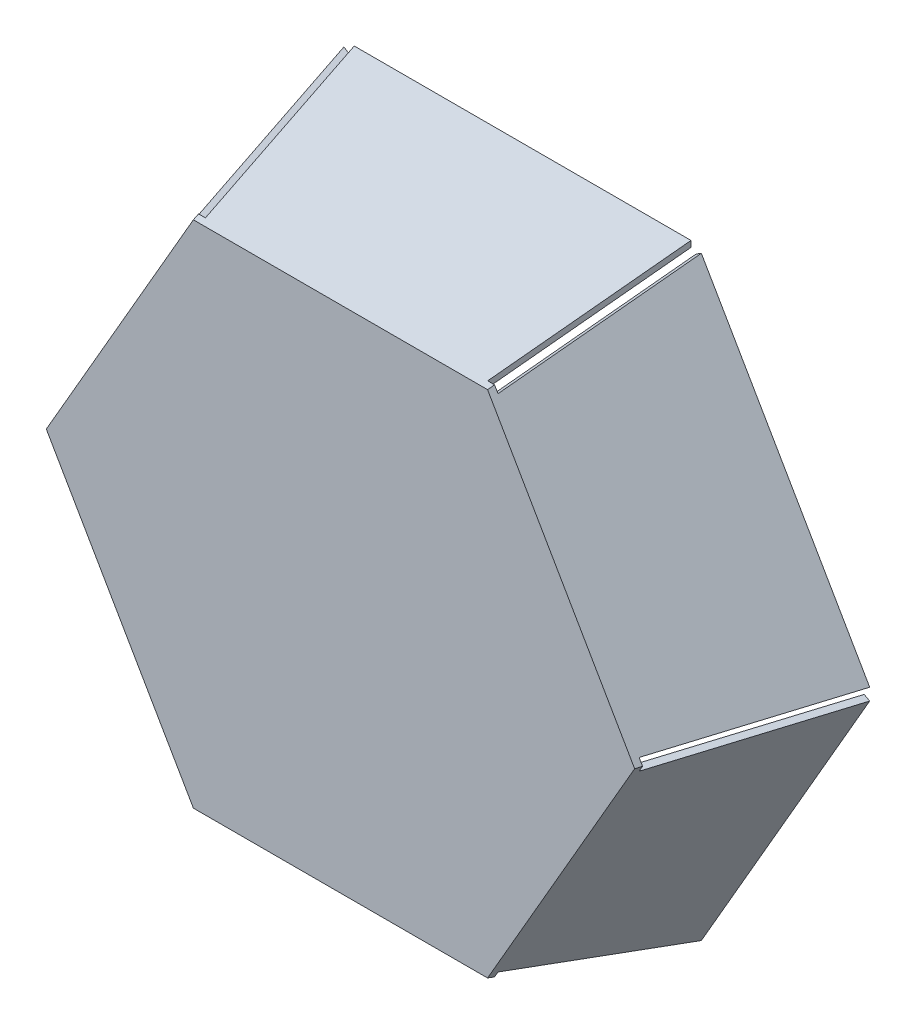
ISO-10303-21;
HEADER;
FILE_DESCRIPTION(('STEP AP214'),'2;1');
FILE_NAME('part.step','',(''),(''),'','','');
FILE_SCHEMA(('AUTOMOTIVE_DESIGN { 1 0 10303 214 1 1 1 1 }'));
ENDSEC;
DATA;
#1=APPLICATION_CONTEXT('core data for automotive mechanical design processes');
#2=APPLICATION_PROTOCOL_DEFINITION('international standard','automotive_design',2000,#1);
#3=PRODUCT_CONTEXT('',#1,'mechanical');
#4=PRODUCT('Part','Part','',(#3));
#5=PRODUCT_RELATED_PRODUCT_CATEGORY('part','',(#4));
#6=PRODUCT_DEFINITION_FORMATION('','',#4);
#7=PRODUCT_DEFINITION_CONTEXT('part definition',#1,'design');
#8=PRODUCT_DEFINITION('design','',#6,#7);
#9=PRODUCT_DEFINITION_SHAPE('','',#8);
#10=(LENGTH_UNIT() NAMED_UNIT(*) SI_UNIT(.MILLI.,.METRE.));
#11=(NAMED_UNIT(*) PLANE_ANGLE_UNIT() SI_UNIT($,.RADIAN.));
#12=(NAMED_UNIT(*) SI_UNIT($,.STERADIAN.) SOLID_ANGLE_UNIT());
#13=UNCERTAINTY_MEASURE_WITH_UNIT(LENGTH_MEASURE(1.E-05),#10,'distance_accuracy_value','');
#14=(GEOMETRIC_REPRESENTATION_CONTEXT(3) GLOBAL_UNCERTAINTY_ASSIGNED_CONTEXT((#13)) GLOBAL_UNIT_ASSIGNED_CONTEXT((#10,
#11,#12)) REPRESENTATION_CONTEXT('',''));
#15=CARTESIAN_POINT('',(0.,0.,0.));
#16=DIRECTION('',(0.,0.,1.));
#17=DIRECTION('',(1.,0.,0.));
#18=AXIS2_PLACEMENT_3D('',#15,#16,#17);
#19=CARTESIAN_POINT('',(-56.8985106152247,0.482962913144534,-0.258819045102521));
#20=DIRECTION('',(-0.836516303737808,-0.482962913144534,0.258819045102521));
#21=DIRECTION('',(0.5,-0.866025403784439,0.));
#22=AXIS2_PLACEMENT_3D('',#19,#20,#21);
#23=PLANE('',#22);
#24=DIRECTION('',(-0.5,0.866025403784439,0.));
#25=VECTOR('',#24,1.);
#26=CARTESIAN_POINT('',(-50.108978027297,4.40290138045633,29.));
#27=LINE('',#26,#25);
#28=CARTESIAN_POINT('',(-47.2782865954804,-0.500000000000001,29.));
#29=VERTEX_POINT('',#28);
#30=CARTESIAN_POINT('',(-24.0721559996324,-40.6941972390873,29.));
#31=VERTEX_POINT('',#30);
#32=EDGE_CURVE('E261',#29,#31,#27,.F.);
#33=ORIENTED_EDGE('',*,*,#32,.T.);
#34=DIRECTION('',(0.147788364107821,0.255976955402234,0.955319003127928));
#35=VECTOR('',#34,1.);
#36=CARTESIAN_POINT('',(-27.3622878055868,-46.3928726905987,7.73225367911405));
#37=LINE('',#36,#35);
#38=CARTESIAN_POINT('',(-28.5584716126307,-48.4647238195899,0.));
#39=VERTEX_POINT('',#38);
#40=EDGE_CURVE('E602',#31,#39,#37,.F.);
#41=ORIENTED_EDGE('',*,*,#40,.T.);
#42=DIRECTION('',(-0.5,0.866025403784439,0.));
#43=VECTOR('',#42,1.);
#44=CARTESIAN_POINT('',(-56.8384514467945,0.517638090205041,0.));
#45=LINE('',#44,#43);
#46=CARTESIAN_POINT('',(-56.250917821477,-0.500000000000004,0.));
#47=VERTEX_POINT('',#46);
#48=EDGE_CURVE('E474',#47,#39,#45,.F.);
#49=ORIENTED_EDGE('',*,*,#48,.F.);
#50=DIRECTION('',(-0.295576728215641,0.,-0.955319003127928));
#51=VECTOR('',#50,1.);
#52=CARTESIAN_POINT('',(-56.3805779066023,-0.500000000000001,-0.419067982838747));
#53=LINE('',#52,#51);
#54=EDGE_CURVE('E357',#47,#29,#53,.F.);
#55=ORIENTED_EDGE('',*,*,#54,.T.);
#56=EDGE_LOOP('',(#33,#41,#49,#55));
#57=FACE_BOUND('',#56,.T.);
#58=ADVANCED_FACE('F35',(#57),#23,.F.);
#59=CARTESIAN_POINT('',(-28.8675134594813,-49.0340741737109,-0.258819045102521));
#60=DIRECTION('',(0.,-0.965925826289068,0.258819045102521));
#61=DIRECTION('',(0.,-0.258819045102521,-0.965925826289068));
#62=AXIS2_PLACEMENT_3D('',#59,#60,#61);
#63=PLANE('',#62);
#64=DIRECTION('',(-1.,0.,0.));
#65=VECTOR('',#64,1.);
#66=CARTESIAN_POINT('',(-28.8675134594813,-48.9647238195899,0.));
#67=LINE('',#66,#65);
#68=CARTESIAN_POINT('',(-27.6924462088463,-48.9647238195899,0.));
#69=VERTEX_POINT('',#68);
#70=CARTESIAN_POINT('',(27.6924462088463,-48.9647238195899,0.));
#71=VERTEX_POINT('',#70);
#72=EDGE_CURVE('E470',#69,#71,#67,.F.);
#73=ORIENTED_EDGE('',*,*,#72,.F.);
#74=DIRECTION('',(-0.147788364107821,-0.255976955402234,-0.955319003127928));
#75=VECTOR('',#74,1.);
#76=CARTESIAN_POINT('',(-27.7572762514089,-49.0770127471653,-0.419067982838747));
#77=LINE('',#76,#75);
#78=CARTESIAN_POINT('',(-23.206130595848,-41.1941972390873,29.));
#79=VERTEX_POINT('',#78);
#80=EDGE_CURVE('E241',#69,#79,#77,.F.);
#81=ORIENTED_EDGE('',*,*,#80,.T.);
#82=DIRECTION('',(-1.,0.,0.));
#83=VECTOR('',#82,1.);
#84=CARTESIAN_POINT('',(-28.8675134594813,-41.1941972390873,29.));
#85=LINE('',#84,#83);
#86=CARTESIAN_POINT('',(23.206130595848,-41.1941972390873,29.));
#87=VERTEX_POINT('',#86);
#88=EDGE_CURVE('E471',#79,#87,#85,.F.);
#89=ORIENTED_EDGE('',*,*,#88,.T.);
#90=DIRECTION('',(-0.147788364107821,0.255976955402234,0.955319003127928));
#91=VECTOR('',#90,1.);
#92=CARTESIAN_POINT('',(26.4962624018024,-46.8928726905987,7.73225367911405));
#93=LINE('',#92,#91);
#94=EDGE_CURVE('E467',#87,#71,#93,.F.);
#95=ORIENTED_EDGE('',*,*,#94,.T.);
#96=EDGE_LOOP('',(#73,#81,#89,#95));
#97=FACE_BOUND('',#96,.T.);
#98=ADVANCED_FACE('F546',(#97),#63,.F.);
#99=CARTESIAN_POINT('',(-57.7350269189625,0.,0.));
#100=DIRECTION('',(-0.836516303737808,-0.482962913144534,0.258819045102521));
#101=DIRECTION('',(0.5,-0.866025403784439,0.));
#102=AXIS2_PLACEMENT_3D('',#99,#100,#101);
#103=PLANE('',#102);
#104=DIRECTION('',(-0.5,0.866025403784439,0.));
#105=VECTOR('',#104,1.);
#106=CARTESIAN_POINT('',(-26.2317936699098,-39.0241474290473,29.));
#107=LINE('',#106,#105);
#108=CARTESIAN_POINT('',(-24.381197846483,-42.2294734194974,29.));
#109=VERTEX_POINT('',#108);
#110=CARTESIAN_POINT('',(-24.9487117489904,-41.2465105063529,29.));
#111=VERTEX_POINT('',#110);
#112=EDGE_CURVE('E318',#109,#111,#107,.T.);
#113=ORIENTED_EDGE('',*,*,#112,.F.);
#114=DIRECTION('',(-0.147788364107821,-0.255976955402234,-0.955319003127928));
#115=VECTOR('',#114,1.);
#116=CARTESIAN_POINT('',(-28.8675134594813,-50.,0.));
#117=LINE('',#116,#115);
#118=CARTESIAN_POINT('',(-24.2264973081037,-41.9615242270663,30.));
#119=VERTEX_POINT('',#118);
#120=EDGE_CURVE('E285',#119,#109,#117,.T.);
#121=ORIENTED_EDGE('',*,*,#120,.F.);
#122=DIRECTION('',(-0.5,0.866025403784439,0.));
#123=VECTOR('',#122,1.);
#124=CARTESIAN_POINT('',(-50.7735026918962,4.01923788646685,30.));
#125=LINE('',#124,#123);
#126=CARTESIAN_POINT('',(-48.4529946162074,0.,30.));
#127=VERTEX_POINT('',#126);
#128=EDGE_CURVE('E39',#127,#119,#125,.F.);
#129=ORIENTED_EDGE('',*,*,#128,.F.);
#130=DIRECTION('',(-0.295576728215641,0.,-0.955319003127928));
#131=VECTOR('',#130,1.);
#132=CARTESIAN_POINT('',(-57.7350269189625,0.,0.));
#133=LINE('',#132,#131);
#134=CARTESIAN_POINT('',(-48.7623956929659,0.,29.));
#135=VERTEX_POINT('',#134);
#136=EDGE_CURVE('E287',#127,#135,#133,.T.);
#137=ORIENTED_EDGE('',*,*,#136,.T.);
#138=DIRECTION('',(-0.500000000000002,0.866025403784438,0.));
#139=VECTOR('',#138,1.);
#140=CARTESIAN_POINT('',(-47.4669184735752,-2.24383236403274,29.));
#141=LINE('',#140,#139);
#142=CARTESIAN_POINT('',(-48.1948817904585,-0.982962913144537,29.));
#143=VERTEX_POINT('',#142);
#144=EDGE_CURVE('E353',#143,#135,#141,.T.);
#145=ORIENTED_EDGE('',*,*,#144,.F.);
#146=DIRECTION('',(-0.295576728215641,0.,-0.955319003127927));
#147=VECTOR('',#146,1.);
#148=CARTESIAN_POINT('',(-43.0625541067807,-0.982962913144537,45.5879438347388));
#149=LINE('',#148,#147);
#150=CARTESIAN_POINT('',(-57.1675130164551,-0.982962913144537,0.));
#151=VERTEX_POINT('',#150);
#152=EDGE_CURVE('E355',#143,#151,#149,.T.);
#153=ORIENTED_EDGE('',*,*,#152,.T.);
#154=DIRECTION('',(0.5,-0.866025403784439,0.));
#155=VECTOR('',#154,1.);
#156=CARTESIAN_POINT('',(-57.7350269189625,0.,0.));
#157=LINE('',#156,#155);
#158=CARTESIAN_POINT('',(-29.4350273619887,-49.0170370868555,0.));
#159=VERTEX_POINT('',#158);
#160=EDGE_CURVE('E281',#151,#159,#157,.T.);
#161=ORIENTED_EDGE('',*,*,#160,.T.);
#162=DIRECTION('',(-0.147788364107821,-0.255976955402234,-0.955319003127927));
#163=VECTOR('',#162,1.);
#164=CARTESIAN_POINT('',(-22.3825479071515,-36.8017843517418,45.5879438347389));
#165=LINE('',#164,#163);
#166=EDGE_CURVE('E834',#111,#159,#165,.T.);
#167=ORIENTED_EDGE('',*,*,#166,.F.);
#168=EDGE_LOOP('',(#113,#121,#129,#137,#145,#153,#161,#167));
#169=FACE_BOUND('',#168,.T.);
#170=ADVANCED_FACE('F316',(#169),#103,.T.);
#171=CARTESIAN_POINT('',(0.,0.,0.));
#172=DIRECTION('',(0.,0.,1.));
#173=DIRECTION('',(1.,0.,0.));
#174=AXIS2_PLACEMENT_3D('',#171,#172,#173);
#175=PLANE('',#174);
#176=ORIENTED_EDGE('',*,*,#48,.T.);
#177=DIRECTION('',(-0.846055322513916,-0.533095105254093,0.));
#178=VECTOR('',#177,1.);
#179=CARTESIAN_POINT('',(-31.5324443112515,-50.3386087141182,0.));
#180=LINE('',#179,#178);
#181=EDGE_CURVE('E245',#39,#159,#180,.T.);
#182=ORIENTED_EDGE('',*,*,#181,.T.);
#183=ORIENTED_EDGE('',*,*,#160,.F.);
#184=DIRECTION('',(0.884701565040142,0.466157849677041,0.));
#185=VECTOR('',#184,1.);
#186=CARTESIAN_POINT('',(-61.0986944446327,-3.05434059988621,0.));
#187=LINE('',#186,#185);
#188=EDGE_CURVE('E600',#151,#47,#187,.T.);
#189=ORIENTED_EDGE('',*,*,#188,.T.);
#190=EDGE_LOOP('',(#176,#182,#183,#189));
#191=FACE_BOUND('',#190,.T.);
#192=ADVANCED_FACE('F565',(#191),#175,.F.);
#193=CARTESIAN_POINT('',(-28.0309971557435,49.5170370868555,-0.258819045102521));
#194=DIRECTION('',(-0.836516303737808,0.482962913144534,0.258819045102521));
#195=DIRECTION('',(-0.5,-0.866025403784439,0.));
#196=AXIS2_PLACEMENT_3D('',#193,#194,#195);
#197=PLANE('',#196);
#198=DIRECTION('',(0.5,0.866025403784439,0.));
#199=VECTOR('',#198,1.);
#200=CARTESIAN_POINT('',(-21.2414645678158,45.5970986195437,29.));
#201=LINE('',#200,#199);
#202=CARTESIAN_POINT('',(-24.0721559996324,40.6941972390873,29.));
#203=VERTEX_POINT('',#202);
#204=CARTESIAN_POINT('',(-47.2782865954804,0.499999999999995,29.));
#205=VERTEX_POINT('',#204);
#206=EDGE_CURVE('E267',#203,#205,#201,.F.);
#207=ORIENTED_EDGE('',*,*,#206,.T.);
#208=DIRECTION('',(0.295576728215641,0.,0.955319003127928));
#209=VECTOR('',#208,1.);
#210=CARTESIAN_POINT('',(-53.8585502073892,0.5,7.73225367911404));
#211=LINE('',#210,#209);
#212=CARTESIAN_POINT('',(-56.250917821477,0.499999999999997,0.));
#213=VERTEX_POINT('',#212);
#214=EDGE_CURVE('E360',#205,#213,#211,.F.);
#215=ORIENTED_EDGE('',*,*,#214,.T.);
#216=DIRECTION('',(0.5,0.866025403784439,0.));
#217=VECTOR('',#216,1.);
#218=CARTESIAN_POINT('',(-27.9709379873132,49.4823619097949,0.));
#219=LINE('',#218,#217);
#220=CARTESIAN_POINT('',(-28.5584716126307,48.4647238195899,0.));
#221=VERTEX_POINT('',#220);
#222=EDGE_CURVE('E488',#221,#213,#219,.F.);
#223=ORIENTED_EDGE('',*,*,#222,.F.);
#224=DIRECTION('',(-0.147788364107821,0.255976955402234,-0.955319003127928));
#225=VECTOR('',#224,1.);
#226=CARTESIAN_POINT('',(-28.6233016551934,48.5770127471653,-0.419067982838747));
#227=LINE('',#226,#225);
#228=EDGE_CURVE('E385',#221,#203,#227,.F.);
#229=ORIENTED_EDGE('',*,*,#228,.T.);
#230=EDGE_LOOP('',(#207,#215,#223,#229));
#231=FACE_BOUND('',#230,.T.);
#232=ADVANCED_FACE('F556',(#231),#197,.F.);
#233=CARTESIAN_POINT('',(-28.8675134594813,50.,0.));
#234=DIRECTION('',(-0.836516303737808,0.482962913144534,0.258819045102521));
#235=DIRECTION('',(-0.5,-0.866025403784439,0.));
#236=AXIS2_PLACEMENT_3D('',#233,#234,#235);
#237=PLANE('',#236);
#238=DIRECTION('',(0.500000000000002,0.866025403784438,0.));
#239=VECTOR('',#238,1.);
#240=CARTESIAN_POINT('',(-46.9117998695391,3.20532599045009,29.));
#241=LINE('',#240,#239);
#242=CARTESIAN_POINT('',(-48.1948817904585,0.982962913144532,29.));
#243=VERTEX_POINT('',#242);
#244=EDGE_CURVE('E350',#135,#243,#241,.T.);
#245=ORIENTED_EDGE('',*,*,#244,.F.);
#246=ORIENTED_EDGE('',*,*,#136,.F.);
#247=DIRECTION('',(0.5,0.866025403784439,0.));
#248=VECTOR('',#247,1.);
#249=CARTESIAN_POINT('',(-21.9059892324149,45.9807621135331,30.));
#250=LINE('',#249,#248);
#251=CARTESIAN_POINT('',(-24.2264973081037,41.9615242270663,30.));
#252=VERTEX_POINT('',#251);
#253=EDGE_CURVE('E305',#252,#127,#250,.F.);
#254=ORIENTED_EDGE('',*,*,#253,.F.);
#255=DIRECTION('',(-0.147788364107821,0.255976955402234,-0.955319003127928));
#256=VECTOR('',#255,1.);
#257=CARTESIAN_POINT('',(-28.8675134594813,50.,0.));
#258=LINE('',#257,#256);
#259=CARTESIAN_POINT('',(-24.381197846483,42.2294734194974,29.));
#260=VERTEX_POINT('',#259);
#261=EDGE_CURVE('E290',#252,#260,#258,.T.);
#262=ORIENTED_EDGE('',*,*,#261,.T.);
#263=DIRECTION('',(0.5,0.866025403784439,0.));
#264=VECTOR('',#263,1.);
#265=CARTESIAN_POINT('',(-25.6766750658737,39.9856410554647,29.));
#266=LINE('',#265,#264);
#267=CARTESIAN_POINT('',(-24.9487117489904,41.2465105063529,29.));
#268=VERTEX_POINT('',#267);
#269=EDGE_CURVE('E383',#268,#260,#266,.T.);
#270=ORIENTED_EDGE('',*,*,#269,.F.);
#271=DIRECTION('',(-0.147788364107821,0.255976955402234,-0.955319003127927));
#272=VECTOR('',#271,1.);
#273=CARTESIAN_POINT('',(-22.3825479071515,36.8017843517418,45.5879438347389));
#274=LINE('',#273,#272);
#275=CARTESIAN_POINT('',(-29.4350273619887,49.0170370868555,0.));
#276=VERTEX_POINT('',#275);
#277=EDGE_CURVE('E386',#268,#276,#274,.T.);
#278=ORIENTED_EDGE('',*,*,#277,.T.);
#279=DIRECTION('',(-0.5,-0.866025403784439,0.));
#280=VECTOR('',#279,1.);
#281=CARTESIAN_POINT('',(-28.8675134594813,50.,0.));
#282=LINE('',#281,#280);
#283=CARTESIAN_POINT('',(-57.1675130164551,0.982962913144531,0.));
#284=VERTEX_POINT('',#283);
#285=EDGE_CURVE('E278',#276,#284,#282,.T.);
#286=ORIENTED_EDGE('',*,*,#285,.T.);
#287=DIRECTION('',(-0.295576728215641,0.,-0.955319003127927));
#288=VECTOR('',#287,1.);
#289=CARTESIAN_POINT('',(-43.0625541067807,0.982962913144531,45.5879438347388));
#290=LINE('',#289,#288);
#291=EDGE_CURVE('E370',#243,#284,#290,.T.);
#292=ORIENTED_EDGE('',*,*,#291,.F.);
#293=EDGE_LOOP('',(#245,#246,#254,#262,#270,#278,#286,#292));
#294=FACE_BOUND('',#293,.T.);
#295=ADVANCED_FACE('F347',(#294),#237,.T.);
#296=ORIENTED_EDGE('',*,*,#222,.T.);
#297=DIRECTION('',(-0.884701565040142,0.466157849677041,0.));
#298=VECTOR('',#297,1.);
#299=CARTESIAN_POINT('',(-59.3607360932168,2.13859345990286,0.));
#300=LINE('',#299,#298);
#301=EDGE_CURVE('E605',#213,#284,#300,.T.);
#302=ORIENTED_EDGE('',*,*,#301,.T.);
#303=ORIENTED_EDGE('',*,*,#285,.F.);
#304=DIRECTION('',(0.846055322513916,-0.533095105254094,0.));
#305=VECTOR('',#304,1.);
#306=CARTESIAN_POINT('',(-33.194483773628,51.385851227172,0.));
#307=LINE('',#306,#305);
#308=EDGE_CURVE('E375',#276,#221,#307,.T.);
#309=ORIENTED_EDGE('',*,*,#308,.T.);
#310=EDGE_LOOP('',(#296,#302,#303,#309));
#311=FACE_BOUND('',#310,.T.);
#312=ADVANCED_FACE('F572',(#311),#175,.F.);
#313=CARTESIAN_POINT('',(28.8675134594813,49.0340741737109,-0.258819045102521));
#314=DIRECTION('',(0.,0.965925826289068,0.258819045102521));
#315=DIRECTION('',(0.,-0.258819045102521,0.965925826289068));
#316=AXIS2_PLACEMENT_3D('',#313,#314,#315);
#317=PLANE('',#316);
#318=DIRECTION('',(1.,0.,0.));
#319=VECTOR('',#318,1.);
#320=CARTESIAN_POINT('',(28.8675134594813,41.1941972390873,29.));
#321=LINE('',#320,#319);
#322=CARTESIAN_POINT('',(23.206130595848,41.1941972390873,29.));
#323=VERTEX_POINT('',#322);
#324=CARTESIAN_POINT('',(-23.206130595848,41.1941972390873,29.));
#325=VERTEX_POINT('',#324);
#326=EDGE_CURVE('E480',#323,#325,#321,.F.);
#327=ORIENTED_EDGE('',*,*,#326,.T.);
#328=DIRECTION('',(0.147788364107821,-0.255976955402234,0.955319003127928));
#329=VECTOR('',#328,1.);
#330=CARTESIAN_POINT('',(-26.4962624018024,46.8928726905987,7.73225367911406));
#331=LINE('',#330,#329);
#332=CARTESIAN_POINT('',(-27.6924462088463,48.9647238195899,0.));
#333=VERTEX_POINT('',#332);
#334=EDGE_CURVE('E395',#325,#333,#331,.F.);
#335=ORIENTED_EDGE('',*,*,#334,.T.);
#336=DIRECTION('',(1.,0.,0.));
#337=VECTOR('',#336,1.);
#338=CARTESIAN_POINT('',(28.8675134594813,48.9647238195899,0.));
#339=LINE('',#338,#337);
#340=CARTESIAN_POINT('',(27.6924462088463,48.9647238195899,0.));
#341=VERTEX_POINT('',#340);
#342=EDGE_CURVE('E491',#341,#333,#339,.F.);
#343=ORIENTED_EDGE('',*,*,#342,.F.);
#344=DIRECTION('',(0.14778836410782,0.255976955402234,-0.955319003127928));
#345=VECTOR('',#344,1.);
#346=CARTESIAN_POINT('',(27.7572762514089,49.0770127471653,-0.419067982838746));
#347=LINE('',#346,#345);
#348=EDGE_CURVE('E408',#341,#323,#347,.F.);
#349=ORIENTED_EDGE('',*,*,#348,.T.);
#350=EDGE_LOOP('',(#327,#335,#343,#349));
#351=FACE_BOUND('',#350,.T.);
#352=ADVANCED_FACE('F533',(#351),#317,.F.);
#353=CARTESIAN_POINT('',(28.8675134594813,50.,0.));
#354=DIRECTION('',(0.,0.965925826289068,0.258819045102521));
#355=DIRECTION('',(0.,-0.258819045102521,0.965925826289068));
#356=AXIS2_PLACEMENT_3D('',#353,#354,#355);
#357=PLANE('',#356);
#358=DIRECTION('',(1.,0.,0.));
#359=VECTOR('',#358,1.);
#360=CARTESIAN_POINT('',(-20.6800061996292,42.2294734194974,29.));
#361=LINE('',#360,#359);
#362=CARTESIAN_POINT('',(-23.2461700414681,42.2294734194974,29.));
#363=VERTEX_POINT('',#362);
#364=EDGE_CURVE('E343',#260,#363,#361,.T.);
#365=ORIENTED_EDGE('',*,*,#364,.F.);
#366=ORIENTED_EDGE('',*,*,#261,.F.);
#367=DIRECTION('',(1.,0.,0.));
#368=VECTOR('',#367,1.);
#369=CARTESIAN_POINT('',(28.8675134594813,41.9615242270663,30.));
#370=LINE('',#369,#368);
#371=CARTESIAN_POINT('',(24.2264973081037,41.9615242270663,30.));
#372=VERTEX_POINT('',#371);
#373=EDGE_CURVE('E304',#372,#252,#370,.F.);
#374=ORIENTED_EDGE('',*,*,#373,.F.);
#375=DIRECTION('',(0.147788364107821,0.255976955402234,-0.955319003127928));
#376=VECTOR('',#375,1.);
#377=CARTESIAN_POINT('',(28.8675134594813,50.,0.));
#378=LINE('',#377,#376);
#379=CARTESIAN_POINT('',(24.381197846483,42.2294734194974,29.));
#380=VERTEX_POINT('',#379);
#381=EDGE_CURVE('E293',#372,#380,#378,.T.);
#382=ORIENTED_EDGE('',*,*,#381,.T.);
#383=DIRECTION('',(1.,0.,0.));
#384=VECTOR('',#383,1.);
#385=CARTESIAN_POINT('',(21.7902434077016,42.2294734194974,29.));
#386=LINE('',#385,#384);
#387=CARTESIAN_POINT('',(23.2461700414681,42.2294734194974,29.));
#388=VERTEX_POINT('',#387);
#389=EDGE_CURVE('E406',#388,#380,#386,.T.);
#390=ORIENTED_EDGE('',*,*,#389,.F.);
#391=DIRECTION('',(0.14778836410782,0.255976955402234,-0.955319003127927));
#392=VECTOR('',#391,1.);
#393=CARTESIAN_POINT('',(20.6800061996293,37.7847472648863,45.5879438347389));
#394=LINE('',#393,#392);
#395=CARTESIAN_POINT('',(27.7324856544664,50.,0.));
#396=VERTEX_POINT('',#395);
#397=EDGE_CURVE('E409',#388,#396,#394,.T.);
#398=ORIENTED_EDGE('',*,*,#397,.T.);
#399=DIRECTION('',(-1.,0.,0.));
#400=VECTOR('',#399,1.);
#401=CARTESIAN_POINT('',(28.8675134594813,50.,0.));
#402=LINE('',#401,#400);
#403=CARTESIAN_POINT('',(-27.7324856544665,50.,0.));
#404=VERTEX_POINT('',#403);
#405=EDGE_CURVE('E275',#396,#404,#402,.T.);
#406=ORIENTED_EDGE('',*,*,#405,.T.);
#407=DIRECTION('',(-0.147788364107821,0.255976955402234,-0.955319003127927));
#408=VECTOR('',#407,1.);
#409=CARTESIAN_POINT('',(-20.6800061996292,37.7847472648863,45.5879438347389));
#410=LINE('',#409,#408);
#411=EDGE_CURVE('E382',#363,#404,#410,.T.);
#412=ORIENTED_EDGE('',*,*,#411,.F.);
#413=EDGE_LOOP('',(#365,#366,#374,#382,#390,#398,#406,#412));
#414=FACE_BOUND('',#413,.T.);
#415=ADVANCED_FACE('F341',(#414),#357,.T.);
#416=ORIENTED_EDGE('',*,*,#342,.T.);
#417=DIRECTION('',(-0.0386462425262262,0.999252954931135,0.));
#418=VECTOR('',#417,1.);
#419=CARTESIAN_POINT('',(-27.8282917819653,52.477202174021,0.));
#420=LINE('',#419,#418);
#421=EDGE_CURVE('E376',#333,#404,#420,.T.);
#422=ORIENTED_EDGE('',*,*,#421,.T.);
#423=ORIENTED_EDGE('',*,*,#405,.F.);
#424=DIRECTION('',(-0.0386462425262262,-0.999252954931135,0.));
#425=VECTOR('',#424,1.);
#426=CARTESIAN_POINT('',(27.9042106710047,54.4401918270582,0.));
#427=LINE('',#426,#425);
#428=EDGE_CURVE('E398',#396,#341,#427,.T.);
#429=ORIENTED_EDGE('',*,*,#428,.T.);
#430=EDGE_LOOP('',(#416,#422,#423,#429));
#431=FACE_BOUND('',#430,.T.);
#432=ADVANCED_FACE('F528',(#431),#175,.F.);
#433=CARTESIAN_POINT('',(56.8985106152247,-0.482962913144518,-0.258819045102521));
#434=DIRECTION('',(0.836516303737808,0.482962913144534,0.258819045102521));
#435=DIRECTION('',(-0.5,0.866025403784439,0.));
#436=AXIS2_PLACEMENT_3D('',#433,#434,#435);
#437=PLANE('',#436);
#438=DIRECTION('',(0.5,-0.866025403784439,0.));
#439=VECTOR('',#438,1.);
#440=CARTESIAN_POINT('',(50.108978027297,-4.40290138045632,29.));
#441=LINE('',#440,#439);
#442=CARTESIAN_POINT('',(47.2782865954804,0.500000000000011,29.));
#443=VERTEX_POINT('',#442);
#444=CARTESIAN_POINT('',(24.0721559996324,40.6941972390873,29.));
#445=VERTEX_POINT('',#444);
#446=EDGE_CURVE('E477',#443,#445,#441,.F.);
#447=ORIENTED_EDGE('',*,*,#446,.T.);
#448=DIRECTION('',(-0.14778836410782,-0.255976955402234,0.955319003127928));
#449=VECTOR('',#448,1.);
#450=CARTESIAN_POINT('',(27.3622878055868,46.3928726905987,7.73225367911407));
#451=LINE('',#450,#449);
#452=CARTESIAN_POINT('',(28.5584716126307,48.4647238195899,0.));
#453=VERTEX_POINT('',#452);
#454=EDGE_CURVE('E420',#445,#453,#451,.F.);
#455=ORIENTED_EDGE('',*,*,#454,.T.);
#456=DIRECTION('',(0.5,-0.866025403784439,0.));
#457=VECTOR('',#456,1.);
#458=CARTESIAN_POINT('',(56.8384514467945,-0.517638090205025,0.));
#459=LINE('',#458,#457);
#460=CARTESIAN_POINT('',(56.250917821477,0.500000000000021,0.));
#461=VERTEX_POINT('',#460);
#462=EDGE_CURVE('E493',#461,#453,#459,.F.);
#463=ORIENTED_EDGE('',*,*,#462,.F.);
#464=DIRECTION('',(0.295576728215641,0.,-0.955319003127928));
#465=VECTOR('',#464,1.);
#466=CARTESIAN_POINT('',(56.3805779066023,0.500000000000019,-0.419067982838747));
#467=LINE('',#466,#465);
#468=EDGE_CURVE('E435',#461,#443,#467,.F.);
#469=ORIENTED_EDGE('',*,*,#468,.T.);
#470=EDGE_LOOP('',(#447,#455,#463,#469));
#471=FACE_BOUND('',#470,.T.);
#472=ADVANCED_FACE('F523',(#471),#437,.F.);
#473=CARTESIAN_POINT('',(57.7350269189626,0.,0.));
#474=DIRECTION('',(0.836516303737808,0.482962913144534,0.258819045102521));
#475=DIRECTION('',(-0.5,0.866025403784439,0.));
#476=AXIS2_PLACEMENT_3D('',#473,#474,#475);
#477=PLANE('',#476);
#478=DIRECTION('',(0.5,-0.866025403784439,0.));
#479=VECTOR('',#478,1.);
#480=CARTESIAN_POINT('',(26.2317936699098,39.0241474290473,29.));
#481=LINE('',#480,#479);
#482=CARTESIAN_POINT('',(24.9487117489904,41.2465105063529,29.));
#483=VERTEX_POINT('',#482);
#484=EDGE_CURVE('E337',#380,#483,#481,.T.);
#485=ORIENTED_EDGE('',*,*,#484,.F.);
#486=ORIENTED_EDGE('',*,*,#381,.F.);
#487=DIRECTION('',(0.5,-0.866025403784439,0.));
#488=VECTOR('',#487,1.);
#489=CARTESIAN_POINT('',(50.7735026918962,-4.01923788646684,30.));
#490=LINE('',#489,#488);
#491=CARTESIAN_POINT('',(48.4529946162074,0.,30.));
#492=VERTEX_POINT('',#491);
#493=EDGE_CURVE('E302',#492,#372,#490,.F.);
#494=ORIENTED_EDGE('',*,*,#493,.F.);
#495=DIRECTION('',(0.295576728215641,0.,-0.955319003127927));
#496=VECTOR('',#495,1.);
#497=CARTESIAN_POINT('',(57.7350269189626,0.,0.));
#498=LINE('',#497,#496);
#499=CARTESIAN_POINT('',(48.762395692966,0.,29.));
#500=VERTEX_POINT('',#499);
#501=EDGE_CURVE('E44',#492,#500,#498,.T.);
#502=ORIENTED_EDGE('',*,*,#501,.T.);
#503=DIRECTION('',(0.500000000000002,-0.866025403784438,0.));
#504=VECTOR('',#503,1.);
#505=CARTESIAN_POINT('',(47.4669184735753,2.24383236403275,29.));
#506=LINE('',#505,#504);
#507=CARTESIAN_POINT('',(48.1948817904585,0.98296291314455,29.));
#508=VERTEX_POINT('',#507);
#509=EDGE_CURVE('E433',#508,#500,#506,.T.);
#510=ORIENTED_EDGE('',*,*,#509,.F.);
#511=DIRECTION('',(0.295576728215641,0.,-0.955319003127927));
#512=VECTOR('',#511,1.);
#513=CARTESIAN_POINT('',(43.0625541067808,0.982962913144544,45.5879438347388));
#514=LINE('',#513,#512);
#515=CARTESIAN_POINT('',(57.1675130164551,0.982962913144557,0.));
#516=VERTEX_POINT('',#515);
#517=EDGE_CURVE('E436',#508,#516,#514,.T.);
#518=ORIENTED_EDGE('',*,*,#517,.T.);
#519=DIRECTION('',(-0.5,0.866025403784438,0.));
#520=VECTOR('',#519,1.);
#521=CARTESIAN_POINT('',(57.7350269189626,0.,0.));
#522=LINE('',#521,#520);
#523=CARTESIAN_POINT('',(29.4350273619887,49.0170370868555,0.));
#524=VERTEX_POINT('',#523);
#525=EDGE_CURVE('E264',#516,#524,#522,.T.);
#526=ORIENTED_EDGE('',*,*,#525,.T.);
#527=DIRECTION('',(0.14778836410782,0.255976955402234,-0.955319003127927));
#528=VECTOR('',#527,1.);
#529=CARTESIAN_POINT('',(22.3825479071515,36.8017843517418,45.5879438347389));
#530=LINE('',#529,#528);
#531=EDGE_CURVE('E405',#483,#524,#530,.T.);
#532=ORIENTED_EDGE('',*,*,#531,.F.);
#533=EDGE_LOOP('',(#485,#486,#494,#502,#510,#518,#526,#532));
#534=FACE_BOUND('',#533,.T.);
#535=ADVANCED_FACE('F334',(#534),#477,.T.);
#536=ORIENTED_EDGE('',*,*,#462,.T.);
#537=DIRECTION('',(0.846055322513916,0.533095105254094,0.));
#538=VECTOR('',#537,1.);
#539=CARTESIAN_POINT('',(31.5324443112515,50.3386087141182,0.));
#540=LINE('',#539,#538);
#541=EDGE_CURVE('E399',#453,#524,#540,.T.);
#542=ORIENTED_EDGE('',*,*,#541,.T.);
#543=ORIENTED_EDGE('',*,*,#525,.F.);
#544=DIRECTION('',(-0.884701565040143,-0.466157849677041,0.));
#545=VECTOR('',#544,1.);
#546=CARTESIAN_POINT('',(61.0986944446327,3.05434059988622,0.));
#547=LINE('',#546,#545);
#548=EDGE_CURVE('E423',#516,#461,#547,.T.);
#549=ORIENTED_EDGE('',*,*,#548,.T.);
#550=EDGE_LOOP('',(#536,#542,#543,#549));
#551=FACE_BOUND('',#550,.T.);
#552=ADVANCED_FACE('F519',(#551),#175,.F.);
#553=CARTESIAN_POINT('',(28.0309971557435,-49.5170370868555,-0.258819045102521));
#554=DIRECTION('',(0.836516303737808,-0.482962913144534,0.258819045102521));
#555=DIRECTION('',(0.5,0.866025403784439,0.));
#556=AXIS2_PLACEMENT_3D('',#553,#554,#555);
#557=PLANE('',#556);
#558=DIRECTION('',(-0.5,-0.866025403784439,0.));
#559=VECTOR('',#558,1.);
#560=CARTESIAN_POINT('',(21.2414645678158,-45.5970986195437,29.));
#561=LINE('',#560,#559);
#562=CARTESIAN_POINT('',(24.0721559996324,-40.6941972390873,29.));
#563=VERTEX_POINT('',#562);
#564=CARTESIAN_POINT('',(47.2782865954804,-0.49999999999998,29.));
#565=VERTEX_POINT('',#564);
#566=EDGE_CURVE('E473',#563,#565,#561,.F.);
#567=ORIENTED_EDGE('',*,*,#566,.T.);
#568=DIRECTION('',(-0.295576728215641,0.,0.955319003127928));
#569=VECTOR('',#568,1.);
#570=CARTESIAN_POINT('',(53.8585502073892,-0.49999999999998,7.73225367911406));
#571=LINE('',#570,#569);
#572=CARTESIAN_POINT('',(56.250917821477,-0.49999999999998,0.));
#573=VERTEX_POINT('',#572);
#574=EDGE_CURVE('E446',#565,#573,#571,.F.);
#575=ORIENTED_EDGE('',*,*,#574,.T.);
#576=DIRECTION('',(-0.5,-0.866025403784439,0.));
#577=VECTOR('',#576,1.);
#578=CARTESIAN_POINT('',(27.9709379873132,-49.4823619097949,0.));
#579=LINE('',#578,#577);
#580=CARTESIAN_POINT('',(28.5584716126307,-48.4647238195899,0.));
#581=VERTEX_POINT('',#580);
#582=EDGE_CURVE('E270',#581,#573,#579,.F.);
#583=ORIENTED_EDGE('',*,*,#582,.F.);
#584=DIRECTION('',(0.147788364107821,-0.255976955402234,-0.955319003127928));
#585=VECTOR('',#584,1.);
#586=CARTESIAN_POINT('',(28.6233016551934,-48.5770127471653,-0.419067982838747));
#587=LINE('',#586,#585);
#588=EDGE_CURVE('E456',#581,#563,#587,.F.);
#589=ORIENTED_EDGE('',*,*,#588,.T.);
#590=EDGE_LOOP('',(#567,#575,#583,#589));
#591=FACE_BOUND('',#590,.T.);
#592=ADVANCED_FACE('F503',(#591),#557,.F.);
#593=CARTESIAN_POINT('',(28.8675134594813,-50.,0.));
#594=DIRECTION('',(0.836516303737808,-0.482962913144534,0.258819045102521));
#595=DIRECTION('',(0.5,0.866025403784439,0.));
#596=AXIS2_PLACEMENT_3D('',#593,#594,#595);
#597=PLANE('',#596);
#598=DIRECTION('',(-0.500000000000001,-0.866025403784438,0.));
#599=VECTOR('',#598,1.);
#600=CARTESIAN_POINT('',(46.9117998695391,-3.20532599045008,29.));
#601=LINE('',#600,#599);
#602=CARTESIAN_POINT('',(48.1948817904585,-0.982962913144521,29.));
#603=VERTEX_POINT('',#602);
#604=EDGE_CURVE('E427',#500,#603,#601,.T.);
#605=ORIENTED_EDGE('',*,*,#604,.F.);
#606=ORIENTED_EDGE('',*,*,#501,.F.);
#607=DIRECTION('',(-0.5,-0.866025403784439,0.));
#608=VECTOR('',#607,1.);
#609=CARTESIAN_POINT('',(21.9059892324149,-45.9807621135331,30.));
#610=LINE('',#609,#608);
#611=CARTESIAN_POINT('',(24.2264973081037,-41.9615242270663,30.));
#612=VERTEX_POINT('',#611);
#613=EDGE_CURVE('E300',#612,#492,#610,.F.);
#614=ORIENTED_EDGE('',*,*,#613,.F.);
#615=DIRECTION('',(0.147788364107821,-0.255976955402234,-0.955319003127927));
#616=VECTOR('',#615,1.);
#617=CARTESIAN_POINT('',(28.8675134594813,-50.,0.));
#618=LINE('',#617,#616);
#619=CARTESIAN_POINT('',(24.381197846483,-42.2294734194974,29.));
#620=VERTEX_POINT('',#619);
#621=EDGE_CURVE('E11',#612,#620,#618,.T.);
#622=ORIENTED_EDGE('',*,*,#621,.T.);
#623=DIRECTION('',(-0.5,-0.866025403784439,0.));
#624=VECTOR('',#623,1.);
#625=CARTESIAN_POINT('',(25.6766750658737,-39.9856410554647,29.));
#626=LINE('',#625,#624);
#627=CARTESIAN_POINT('',(24.9487117489904,-41.2465105063529,29.));
#628=VERTEX_POINT('',#627);
#629=EDGE_CURVE('E326',#628,#620,#626,.T.);
#630=ORIENTED_EDGE('',*,*,#629,.F.);
#631=DIRECTION('',(0.147788364107821,-0.255976955402234,-0.955319003127927));
#632=VECTOR('',#631,1.);
#633=CARTESIAN_POINT('',(22.3825479071515,-36.8017843517418,45.5879438347388));
#634=LINE('',#633,#632);
#635=CARTESIAN_POINT('',(29.4350273619887,-49.0170370868555,0.));
#636=VERTEX_POINT('',#635);
#637=EDGE_CURVE('E457',#628,#636,#634,.T.);
#638=ORIENTED_EDGE('',*,*,#637,.T.);
#639=DIRECTION('',(0.5,0.866025403784439,0.));
#640=VECTOR('',#639,1.);
#641=CARTESIAN_POINT('',(28.8675134594813,-50.,0.));
#642=LINE('',#641,#640);
#643=CARTESIAN_POINT('',(57.1675130164551,-0.982962913144518,0.));
#644=VERTEX_POINT('',#643);
#645=EDGE_CURVE('E260',#636,#644,#642,.T.);
#646=ORIENTED_EDGE('',*,*,#645,.T.);
#647=DIRECTION('',(0.295576728215641,0.,-0.955319003127927));
#648=VECTOR('',#647,1.);
#649=CARTESIAN_POINT('',(43.0625541067808,-0.982962913144525,45.5879438347388));
#650=LINE('',#649,#648);
#651=EDGE_CURVE('E432',#603,#644,#650,.T.);
#652=ORIENTED_EDGE('',*,*,#651,.F.);
#653=EDGE_LOOP('',(#605,#606,#614,#622,#630,#638,#646,#652));
#654=FACE_BOUND('',#653,.T.);
#655=ADVANCED_FACE('F37',(#654),#597,.T.);
#656=ORIENTED_EDGE('',*,*,#582,.T.);
#657=DIRECTION('',(0.884701565040143,-0.46615784967704,0.));
#658=VECTOR('',#657,1.);
#659=CARTESIAN_POINT('',(59.3607360932168,-2.13859345990284,0.));
#660=LINE('',#659,#658);
#661=EDGE_CURVE('E424',#573,#644,#660,.T.);
#662=ORIENTED_EDGE('',*,*,#661,.T.);
#663=ORIENTED_EDGE('',*,*,#645,.F.);
#664=DIRECTION('',(-0.846055322513916,0.533095105254094,0.));
#665=VECTOR('',#664,1.);
#666=CARTESIAN_POINT('',(33.194483773628,-51.385851227172,0.));
#667=LINE('',#666,#665);
#668=EDGE_CURVE('E449',#636,#581,#667,.T.);
#669=ORIENTED_EDGE('',*,*,#668,.T.);
#670=EDGE_LOOP('',(#656,#662,#663,#669));
#671=FACE_BOUND('',#670,.T.);
#672=ADVANCED_FACE('F500',(#671),#175,.F.);
#673=CARTESIAN_POINT('',(-28.8675134594813,-50.,0.));
#674=DIRECTION('',(0.,-0.965925826289068,0.258819045102521));
#675=DIRECTION('',(0.,-0.258819045102521,-0.965925826289068));
#676=AXIS2_PLACEMENT_3D('',#673,#674,#675);
#677=PLANE('',#676);
#678=DIRECTION('',(-1.,0.,0.));
#679=VECTOR('',#678,1.);
#680=CARTESIAN_POINT('',(-21.7902434077016,-42.2294734194974,29.));
#681=LINE('',#680,#679);
#682=CARTESIAN_POINT('',(-23.2461700414681,-42.2294734194974,29.));
#683=VERTEX_POINT('',#682);
#684=EDGE_CURVE('E253',#683,#109,#681,.T.);
#685=ORIENTED_EDGE('',*,*,#684,.F.);
#686=DIRECTION('',(-0.147788364107821,-0.255976955402234,-0.955319003127927));
#687=VECTOR('',#686,1.);
#688=CARTESIAN_POINT('',(-20.6800061996292,-37.7847472648863,45.5879438347389));
#689=LINE('',#688,#687);
#690=CARTESIAN_POINT('',(-27.7324856544664,-50.,0.));
#691=VERTEX_POINT('',#690);
#692=EDGE_CURVE('E238',#683,#691,#689,.T.);
#693=ORIENTED_EDGE('',*,*,#692,.T.);
#694=DIRECTION('',(1.,0.,0.));
#695=VECTOR('',#694,1.);
#696=CARTESIAN_POINT('',(-28.8675134594813,-50.,0.));
#697=LINE('',#696,#695);
#698=CARTESIAN_POINT('',(27.7324856544665,-50.,0.));
#699=VERTEX_POINT('',#698);
#700=EDGE_CURVE('E250',#691,#699,#697,.T.);
#701=ORIENTED_EDGE('',*,*,#700,.T.);
#702=DIRECTION('',(0.147788364107821,-0.255976955402234,-0.955319003127927));
#703=VECTOR('',#702,1.);
#704=CARTESIAN_POINT('',(20.6800061996293,-37.7847472648863,45.5879438347388));
#705=LINE('',#704,#703);
#706=CARTESIAN_POINT('',(23.2461700414681,-42.2294734194974,29.));
#707=VERTEX_POINT('',#706);
#708=EDGE_CURVE('E454',#707,#699,#705,.T.);
#709=ORIENTED_EDGE('',*,*,#708,.F.);
#710=DIRECTION('',(-1.,0.,0.));
#711=VECTOR('',#710,1.);
#712=CARTESIAN_POINT('',(20.6800061996293,-42.2294734194974,29.));
#713=LINE('',#712,#711);
#714=EDGE_CURVE('E321',#620,#707,#713,.T.);
#715=ORIENTED_EDGE('',*,*,#714,.F.);
#716=ORIENTED_EDGE('',*,*,#621,.F.);
#717=DIRECTION('',(-1.,0.,0.));
#718=VECTOR('',#717,1.);
#719=CARTESIAN_POINT('',(-28.8675134594813,-41.9615242270663,30.));
#720=LINE('',#719,#718);
#721=EDGE_CURVE('E283',#119,#612,#720,.F.);
#722=ORIENTED_EDGE('',*,*,#721,.F.);
#723=ORIENTED_EDGE('',*,*,#120,.T.);
#724=EDGE_LOOP('',(#685,#693,#701,#709,#715,#716,#722,#723));
#725=FACE_BOUND('',#724,.T.);
#726=ADVANCED_FACE('F248',(#725),#677,.T.);
#727=CARTESIAN_POINT('',(0.,0.,30.));
#728=DIRECTION('',(0.,0.,1.));
#729=DIRECTION('',(1.,0.,0.));
#730=AXIS2_PLACEMENT_3D('',#727,#728,#729);
#731=PLANE('',#730);
#732=ORIENTED_EDGE('',*,*,#721,.T.);
#733=ORIENTED_EDGE('',*,*,#613,.T.);
#734=ORIENTED_EDGE('',*,*,#493,.T.);
#735=ORIENTED_EDGE('',*,*,#373,.T.);
#736=ORIENTED_EDGE('',*,*,#253,.T.);
#737=ORIENTED_EDGE('',*,*,#128,.T.);
#738=EDGE_LOOP('',(#732,#733,#734,#735,#736,#737));
#739=FACE_BOUND('',#738,.T.);
#740=ADVANCED_FACE('F311',(#739),#731,.T.);
#741=ORIENTED_EDGE('',*,*,#700,.F.);
#742=DIRECTION('',(0.0386462425262263,0.999252954931135,0.));
#743=VECTOR('',#742,1.);
#744=CARTESIAN_POINT('',(-27.9042106710047,-54.4401918270582,0.));
#745=LINE('',#744,#743);
#746=EDGE_CURVE('E235',#691,#69,#745,.T.);
#747=ORIENTED_EDGE('',*,*,#746,.T.);
#748=ORIENTED_EDGE('',*,*,#72,.T.);
#749=DIRECTION('',(0.0386462425262262,-0.999252954931135,0.));
#750=VECTOR('',#749,1.);
#751=CARTESIAN_POINT('',(27.8282917819653,-52.477202174021,0.));
#752=LINE('',#751,#750);
#753=EDGE_CURVE('E259',#71,#699,#752,.T.);
#754=ORIENTED_EDGE('',*,*,#753,.T.);
#755=EDGE_LOOP('',(#741,#747,#748,#754));
#756=FACE_BOUND('',#755,.T.);
#757=ADVANCED_FACE('F257',(#756),#175,.F.);
#758=CARTESIAN_POINT('',(0.,0.,29.));
#759=DIRECTION('',(0.,0.,1.));
#760=DIRECTION('',(1.,0.,0.));
#761=AXIS2_PLACEMENT_3D('',#758,#759,#760);
#762=PLANE('',#761);
#763=ORIENTED_EDGE('',*,*,#88,.F.);
#764=DIRECTION('',(-0.0386462425262263,-0.999252954931135,0.));
#765=VECTOR('',#764,1.);
#766=CARTESIAN_POINT('',(-23.0706937499612,-37.6922871021031,29.));
#767=LINE('',#766,#765);
#768=EDGE_CURVE('E254',#79,#683,#767,.T.);
#769=ORIENTED_EDGE('',*,*,#768,.T.);
#770=ORIENTED_EDGE('',*,*,#684,.T.);
#771=ORIENTED_EDGE('',*,*,#112,.T.);
#772=DIRECTION('',(0.846055322513916,0.533095105254093,0.));
#773=VECTOR('',#772,1.);
#774=CARTESIAN_POINT('',(-19.4450918198007,-37.7787079083949,29.));
#775=LINE('',#774,#773);
#776=EDGE_CURVE('E52',#111,#31,#775,.T.);
#777=ORIENTED_EDGE('',*,*,#776,.T.);
#778=ORIENTED_EDGE('',*,*,#32,.F.);
#779=DIRECTION('',(-0.884701565040142,-0.466157849677041,0.));
#780=VECTOR('',#779,1.);
#781=CARTESIAN_POINT('',(-44.1778250321384,1.13366331934571,29.));
#782=LINE('',#781,#780);
#783=EDGE_CURVE('E362',#29,#143,#782,.T.);
#784=ORIENTED_EDGE('',*,*,#783,.T.);
#785=ORIENTED_EDGE('',*,*,#144,.T.);
#786=ORIENTED_EDGE('',*,*,#244,.T.);
#787=DIRECTION('',(0.884701565040142,-0.466157849677041,0.));
#788=VECTOR('',#787,1.);
#789=CARTESIAN_POINT('',(-42.4398666807225,-2.04941045932906,29.));
#790=LINE('',#789,#788);
#791=EDGE_CURVE('E368',#243,#205,#790,.T.);
#792=ORIENTED_EDGE('',*,*,#791,.T.);
#793=ORIENTED_EDGE('',*,*,#206,.F.);
#794=DIRECTION('',(-0.846055322513916,0.533095105254094,0.));
#795=VECTOR('',#794,1.);
#796=CARTESIAN_POINT('',(-21.1071312821772,38.8259504214488,29.));
#797=LINE('',#796,#795);
#798=EDGE_CURVE('E387',#203,#268,#797,.T.);
#799=ORIENTED_EDGE('',*,*,#798,.T.);
#800=ORIENTED_EDGE('',*,*,#269,.T.);
#801=ORIENTED_EDGE('',*,*,#364,.T.);
#802=DIRECTION('',(0.0386462425262262,-0.999252954931135,0.));
#803=VECTOR('',#802,1.);
#804=CARTESIAN_POINT('',(-22.9947748609217,35.7292974490659,29.));
#805=LINE('',#804,#803);
#806=EDGE_CURVE('E59',#363,#325,#805,.T.);
#807=ORIENTED_EDGE('',*,*,#806,.T.);
#808=ORIENTED_EDGE('',*,*,#326,.F.);
#809=DIRECTION('',(0.0386462425262262,0.999252954931135,0.));
#810=VECTOR('',#809,1.);
#811=CARTESIAN_POINT('',(23.0706937499612,37.6922871021031,29.));
#812=LINE('',#811,#810);
#813=EDGE_CURVE('E410',#323,#388,#812,.T.);
#814=ORIENTED_EDGE('',*,*,#813,.T.);
#815=ORIENTED_EDGE('',*,*,#389,.T.);
#816=ORIENTED_EDGE('',*,*,#484,.T.);
#817=DIRECTION('',(-0.846055322513916,-0.533095105254094,0.));
#818=VECTOR('',#817,1.);
#819=CARTESIAN_POINT('',(19.4450918198007,37.7787079083949,29.));
#820=LINE('',#819,#818);
#821=EDGE_CURVE('E412',#483,#445,#820,.T.);
#822=ORIENTED_EDGE('',*,*,#821,.T.);
#823=ORIENTED_EDGE('',*,*,#446,.F.);
#824=DIRECTION('',(0.884701565040143,0.466157849677041,0.));
#825=VECTOR('',#824,1.);
#826=CARTESIAN_POINT('',(44.1778250321384,-1.1336633193457,29.));
#827=LINE('',#826,#825);
#828=EDGE_CURVE('E437',#443,#508,#827,.T.);
#829=ORIENTED_EDGE('',*,*,#828,.T.);
#830=ORIENTED_EDGE('',*,*,#509,.T.);
#831=ORIENTED_EDGE('',*,*,#604,.T.);
#832=DIRECTION('',(-0.884701565040143,0.46615784967704,0.));
#833=VECTOR('',#832,1.);
#834=CARTESIAN_POINT('',(42.4398666807225,2.04941045932907,29.));
#835=LINE('',#834,#833);
#836=EDGE_CURVE('E439',#603,#565,#835,.T.);
#837=ORIENTED_EDGE('',*,*,#836,.T.);
#838=ORIENTED_EDGE('',*,*,#566,.F.);
#839=DIRECTION('',(0.846055322513916,-0.533095105254094,0.));
#840=VECTOR('',#839,1.);
#841=CARTESIAN_POINT('',(21.1071312821772,-38.8259504214488,29.));
#842=LINE('',#841,#840);
#843=EDGE_CURVE('E458',#563,#628,#842,.T.);
#844=ORIENTED_EDGE('',*,*,#843,.T.);
#845=ORIENTED_EDGE('',*,*,#629,.T.);
#846=ORIENTED_EDGE('',*,*,#714,.T.);
#847=DIRECTION('',(-0.0386462425262262,0.999252954931135,0.));
#848=VECTOR('',#847,1.);
#849=CARTESIAN_POINT('',(22.9947748609217,-35.7292974490659,29.));
#850=LINE('',#849,#848);
#851=EDGE_CURVE('E460',#707,#87,#850,.T.);
#852=ORIENTED_EDGE('',*,*,#851,.T.);
#853=EDGE_LOOP('',(#763,#769,#770,#771,#777,#778,#784,#785,#786,#792,#793,#799,#800,#801,#807,
#808,#814,#815,#816,#822,#823,#829,#830,#831,#837,#838,#844,#845,#846,#852));
#854=FACE_BOUND('',#853,.T.);
#855=ADVANCED_FACE('F513',(#854),#762,.F.);
#856=CARTESIAN_POINT('',(20.6800061996293,-35.8188214385972,45.0611755972052));
#857=DIRECTION('',(0.989019008631449,0.0382504432756498,0.142752597716756));
#858=DIRECTION('',(0.142857142857143,0.,-0.989743318610787));
#859=AXIS2_PLACEMENT_3D('',#856,#857,#858);
#860=PLANE('',#859);
#861=ORIENTED_EDGE('',*,*,#851,.F.);
#862=ORIENTED_EDGE('',*,*,#708,.T.);
#863=ORIENTED_EDGE('',*,*,#753,.F.);
#864=ORIENTED_EDGE('',*,*,#94,.F.);
#865=EDGE_LOOP('',(#861,#862,#863,#864));
#866=FACE_BOUND('',#865,.T.);
#867=ADVANCED_FACE('F560',(#866),#860,.T.);
#868=CARTESIAN_POINT('',(22.3825479071515,-36.8017843517418,45.5879438347388));
#869=DIRECTION('',(-0.527635359898453,-0.837390364662711,0.142752597716756));
#870=DIRECTION('',(0.846055322513916,-0.533095105254094,0.));
#871=AXIS2_PLACEMENT_3D('',#868,#869,#870);
#872=PLANE('',#871);
#873=ORIENTED_EDGE('',*,*,#668,.F.);
#874=ORIENTED_EDGE('',*,*,#637,.F.);
#875=ORIENTED_EDGE('',*,*,#843,.F.);
#876=ORIENTED_EDGE('',*,*,#588,.F.);
#877=EDGE_LOOP('',(#873,#874,#875,#876));
#878=FACE_BOUND('',#877,.T.);
#879=ADVANCED_FACE('F511',(#878),#872,.T.);
#880=CARTESIAN_POINT('',(41.3600123992585,0.,45.0611755972052));
#881=DIRECTION('',(0.461383648732995,0.875640807938361,0.142752597716756));
#882=DIRECTION('',(-0.884701565040143,0.46615784967704,0.));
#883=AXIS2_PLACEMENT_3D('',#880,#881,#882);
#884=PLANE('',#883);
#885=ORIENTED_EDGE('',*,*,#836,.F.);
#886=ORIENTED_EDGE('',*,*,#651,.T.);
#887=ORIENTED_EDGE('',*,*,#661,.F.);
#888=ORIENTED_EDGE('',*,*,#574,.F.);
#889=EDGE_LOOP('',(#885,#886,#887,#888));
#890=FACE_BOUND('',#889,.T.);
#891=ADVANCED_FACE('F507',(#890),#884,.T.);
#892=CARTESIAN_POINT('',(43.0625541067808,0.982962913144544,45.5879438347388));
#893=DIRECTION('',(0.461383648732996,-0.875640807938361,0.142752597716756));
#894=DIRECTION('',(0.884701565040143,0.466157849677041,0.));
#895=AXIS2_PLACEMENT_3D('',#892,#893,#894);
#896=PLANE('',#895);
#897=ORIENTED_EDGE('',*,*,#548,.F.);
#898=ORIENTED_EDGE('',*,*,#517,.F.);
#899=ORIENTED_EDGE('',*,*,#828,.F.);
#900=ORIENTED_EDGE('',*,*,#468,.F.);
#901=EDGE_LOOP('',(#897,#898,#899,#900));
#902=FACE_BOUND('',#901,.T.);
#903=ADVANCED_FACE('F543',(#902),#896,.T.);
#904=CARTESIAN_POINT('',(20.6800061996293,35.8188214385972,45.0611755972052));
#905=DIRECTION('',(-0.527635359898453,0.837390364662711,0.142752597716757));
#906=DIRECTION('',(-0.846055322513916,-0.533095105254094,0.));
#907=AXIS2_PLACEMENT_3D('',#904,#905,#906);
#908=PLANE('',#907);
#909=ORIENTED_EDGE('',*,*,#821,.F.);
#910=ORIENTED_EDGE('',*,*,#531,.T.);
#911=ORIENTED_EDGE('',*,*,#541,.F.);
#912=ORIENTED_EDGE('',*,*,#454,.F.);
#913=EDGE_LOOP('',(#909,#910,#911,#912));
#914=FACE_BOUND('',#913,.T.);
#915=ADVANCED_FACE('F521',(#914),#908,.T.);
#916=CARTESIAN_POINT('',(20.6800061996293,37.7847472648863,45.5879438347389));
#917=DIRECTION('',(0.989019008631449,-0.0382504432756498,0.142752597716756));
#918=DIRECTION('',(0.142857142857143,0.,-0.989743318610787));
#919=AXIS2_PLACEMENT_3D('',#916,#917,#918);
#920=PLANE('',#919);
#921=ORIENTED_EDGE('',*,*,#428,.F.);
#922=ORIENTED_EDGE('',*,*,#397,.F.);
#923=ORIENTED_EDGE('',*,*,#813,.F.);
#924=ORIENTED_EDGE('',*,*,#348,.F.);
#925=EDGE_LOOP('',(#921,#922,#923,#924));
#926=FACE_BOUND('',#925,.T.);
#927=ADVANCED_FACE('F534',(#926),#920,.T.);
#928=CARTESIAN_POINT('',(-20.6800061996292,35.8188214385972,45.0611755972052));
#929=DIRECTION('',(-0.989019008631449,-0.0382504432756498,0.142752597716756));
#930=DIRECTION('',(0.142857142857143,0.,0.989743318610787));
#931=AXIS2_PLACEMENT_3D('',#928,#929,#930);
#932=PLANE('',#931);
#933=ORIENTED_EDGE('',*,*,#806,.F.);
#934=ORIENTED_EDGE('',*,*,#411,.T.);
#935=ORIENTED_EDGE('',*,*,#421,.F.);
#936=ORIENTED_EDGE('',*,*,#334,.F.);
#937=EDGE_LOOP('',(#933,#934,#935,#936));
#938=FACE_BOUND('',#937,.T.);
#939=ADVANCED_FACE('F531',(#938),#932,.T.);
#940=CARTESIAN_POINT('',(-22.3825479071515,36.8017843517418,45.5879438347389));
#941=DIRECTION('',(0.527635359898453,0.837390364662711,0.142752597716756));
#942=DIRECTION('',(-0.846055322513916,0.533095105254094,0.));
#943=AXIS2_PLACEMENT_3D('',#940,#941,#942);
#944=PLANE('',#943);
#945=ORIENTED_EDGE('',*,*,#308,.F.);
#946=ORIENTED_EDGE('',*,*,#277,.F.);
#947=ORIENTED_EDGE('',*,*,#798,.F.);
#948=ORIENTED_EDGE('',*,*,#228,.F.);
#949=EDGE_LOOP('',(#945,#946,#947,#948));
#950=FACE_BOUND('',#949,.T.);
#951=ADVANCED_FACE('F541',(#950),#944,.T.);
#952=CARTESIAN_POINT('',(-41.3600123992585,0.,45.0611755972052));
#953=DIRECTION('',(-0.461383648732996,-0.875640807938361,0.142752597716756));
#954=DIRECTION('',(0.884701565040142,-0.466157849677041,0.));
#955=AXIS2_PLACEMENT_3D('',#952,#953,#954);
#956=PLANE('',#955);
#957=ORIENTED_EDGE('',*,*,#791,.F.);
#958=ORIENTED_EDGE('',*,*,#291,.T.);
#959=ORIENTED_EDGE('',*,*,#301,.F.);
#960=ORIENTED_EDGE('',*,*,#214,.F.);
#961=EDGE_LOOP('',(#957,#958,#959,#960));
#962=FACE_BOUND('',#961,.T.);
#963=ADVANCED_FACE('F613',(#962),#956,.T.);
#964=CARTESIAN_POINT('',(-43.0625541067807,-0.982962913144537,45.5879438347388));
#965=DIRECTION('',(-0.461383648732997,0.87564080793836,0.142752597716756));
#966=DIRECTION('',(-0.884701565040142,-0.466157849677041,0.));
#967=AXIS2_PLACEMENT_3D('',#964,#965,#966);
#968=PLANE('',#967);
#969=ORIENTED_EDGE('',*,*,#188,.F.);
#970=ORIENTED_EDGE('',*,*,#152,.F.);
#971=ORIENTED_EDGE('',*,*,#783,.F.);
#972=ORIENTED_EDGE('',*,*,#54,.F.);
#973=EDGE_LOOP('',(#969,#970,#971,#972));
#974=FACE_BOUND('',#973,.T.);
#975=ADVANCED_FACE('F622',(#974),#968,.T.);
#976=CARTESIAN_POINT('',(-20.6800061996292,-35.8188214385972,45.0611755972052));
#977=DIRECTION('',(0.527635359898453,-0.837390364662711,0.142752597716756));
#978=DIRECTION('',(0.846055322513916,0.533095105254093,0.));
#979=AXIS2_PLACEMENT_3D('',#976,#977,#978);
#980=PLANE('',#979);
#981=ORIENTED_EDGE('',*,*,#776,.F.);
#982=ORIENTED_EDGE('',*,*,#166,.T.);
#983=ORIENTED_EDGE('',*,*,#181,.F.);
#984=ORIENTED_EDGE('',*,*,#40,.F.);
#985=EDGE_LOOP('',(#981,#982,#983,#984));
#986=FACE_BOUND('',#985,.T.);
#987=ADVANCED_FACE('F627',(#986),#980,.T.);
#988=CARTESIAN_POINT('',(-20.6800061996292,-37.7847472648863,45.5879438347389));
#989=DIRECTION('',(-0.989019008631449,0.0382504432756499,0.142752597716756));
#990=DIRECTION('',(0.142857142857143,0.,0.989743318610787));
#991=AXIS2_PLACEMENT_3D('',#988,#989,#990);
#992=PLANE('',#991);
#993=ORIENTED_EDGE('',*,*,#746,.F.);
#994=ORIENTED_EDGE('',*,*,#692,.F.);
#995=ORIENTED_EDGE('',*,*,#768,.F.);
#996=ORIENTED_EDGE('',*,*,#80,.F.);
#997=EDGE_LOOP('',(#993,#994,#995,#996));
#998=FACE_BOUND('',#997,.T.);
#999=ADVANCED_FACE('F237',(#998),#992,.T.);
#1000=CLOSED_SHELL('',(#58,#98,#170,#192,#232,#295,#312,#352,#415,#432,#472,#535,#552,#592,#655,
#672,#726,#740,#757,#855,#867,#879,#891,#903,#915,#927,#939,#951,#963,#975,#987,#999));
#1001=MANIFOLD_SOLID_BREP('B2',#1000);
#1002=ADVANCED_BREP_SHAPE_REPRESENTATION('',(#18,#1001),#14);
#1003=SHAPE_DEFINITION_REPRESENTATION(#9,#1002);
ENDSEC;
END-ISO-10303-21;
